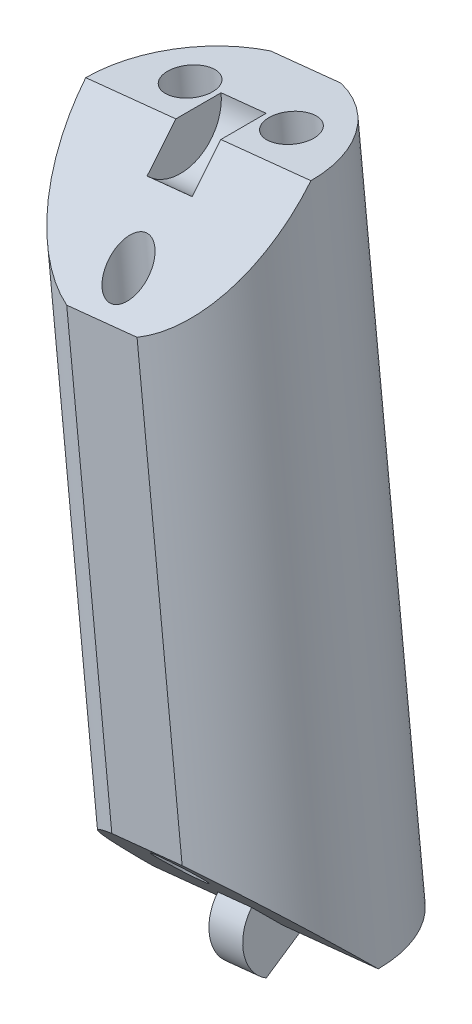
ISO-10303-21;
HEADER;
FILE_DESCRIPTION(('STEP AP214'),'2;1');
FILE_NAME('part.step','',(''),(''),'','','');
FILE_SCHEMA(('AUTOMOTIVE_DESIGN { 1 0 10303 214 1 1 1 1 }'));
ENDSEC;
DATA;
#1=APPLICATION_CONTEXT('core data for automotive mechanical design processes');
#2=APPLICATION_PROTOCOL_DEFINITION('international standard','automotive_design',2000,#1);
#3=PRODUCT_CONTEXT('',#1,'mechanical');
#4=PRODUCT('Part','Part','',(#3));
#5=PRODUCT_RELATED_PRODUCT_CATEGORY('part','',(#4));
#6=PRODUCT_DEFINITION_FORMATION('','',#4);
#7=PRODUCT_DEFINITION_CONTEXT('part definition',#1,'design');
#8=PRODUCT_DEFINITION('design','',#6,#7);
#9=PRODUCT_DEFINITION_SHAPE('','',#8);
#10=(LENGTH_UNIT() NAMED_UNIT(*) SI_UNIT(.MILLI.,.METRE.));
#11=(NAMED_UNIT(*) PLANE_ANGLE_UNIT() SI_UNIT($,.RADIAN.));
#12=(NAMED_UNIT(*) SI_UNIT($,.STERADIAN.) SOLID_ANGLE_UNIT());
#13=UNCERTAINTY_MEASURE_WITH_UNIT(LENGTH_MEASURE(1.E-05),#10,'distance_accuracy_value','');
#14=(GEOMETRIC_REPRESENTATION_CONTEXT(3) GLOBAL_UNCERTAINTY_ASSIGNED_CONTEXT((#13)) GLOBAL_UNIT_ASSIGNED_CONTEXT((#10,
#11,#12)) REPRESENTATION_CONTEXT('',''));
#15=CARTESIAN_POINT('',(0.,0.,0.));
#16=DIRECTION('',(0.,0.,1.));
#17=DIRECTION('',(1.,0.,0.));
#18=AXIS2_PLACEMENT_3D('',#15,#16,#17);
#19=CARTESIAN_POINT('',(-5.21308669792322,151.397041510452,0.));
#20=DIRECTION('',(-0.103150523023817,0.994665757729657,0.));
#21=DIRECTION('',(-0.994665757729657,-0.103150523023817,0.));
#22=AXIS2_PLACEMENT_3D('',#19,#20,#21);
#23=CYLINDRICAL_SURFACE('',#22,8.);
#24=CARTESIAN_POINT('',(-5.21308669792322,151.397041510452,0.));
#25=DIRECTION('',(0.103150523023817,-0.994665757729657,0.));
#26=DIRECTION('',(0.994665757729657,0.103150523023817,0.));
#27=AXIS2_PLACEMENT_3D('',#24,#25,#26);
#28=CIRCLE('',#27,8.);
#29=CARTESIAN_POINT('',(-2.72841243148436,151.654711434379,-7.6));
#30=VERTEX_POINT('',#29);
#31=CARTESIAN_POINT('',(2.74423936391403,152.222245694643,0.));
#32=VERTEX_POINT('',#31);
#33=EDGE_CURVE('E156',#30,#32,#28,.T.);
#34=ORIENTED_EDGE('',*,*,#33,.F.);
#35=DIRECTION('',(-0.103150523023817,0.994665757729657,0.));
#36=VECTOR('',#35,1.);
#37=CARTESIAN_POINT('',(-2.72841243148436,151.654711434379,-7.6));
#38=LINE('',#37,#36);
#39=CARTESIAN_POINT('',(-7.48403157112503,197.512467423771,-7.6));
#40=VERTEX_POINT('',#39);
#41=EDGE_CURVE('E11',#30,#40,#38,.T.);
#42=ORIENTED_EDGE('',*,*,#41,.T.);
#43=CARTESIAN_POINT('',(-9.9687058375639,197.254797499844,0.));
#44=DIRECTION('',(0.103150523023817,-0.994665757729657,0.));
#45=DIRECTION('',(0.994665757729657,0.103150523023817,0.));
#46=AXIS2_PLACEMENT_3D('',#43,#44,#45);
#47=CIRCLE('',#46,8.);
#48=CARTESIAN_POINT('',(-2.01137977572664,198.080001684034,0.));
#49=VERTEX_POINT('',#48);
#50=EDGE_CURVE('E148',#40,#49,#47,.T.);
#51=ORIENTED_EDGE('',*,*,#50,.T.);
#52=CARTESIAN_POINT('',(-9.9687058375639,197.254797499844,0.));
#53=DIRECTION('',(0.0729384343130804,-0.703334902304701,-0.707106781186543));
#54=DIRECTION('',(-0.0729384343130795,0.703334902304692,-0.707106781186552));
#55=AXIS2_PLACEMENT_3D('',#52,#53,#54);
#56=ELLIPSE('',#55,11.3137084989847,8.);
#57=CARTESIAN_POINT('',(-6.70008759614404,189.953007665026,7.6));
#58=VERTEX_POINT('',#57);
#59=EDGE_CURVE('E202',#49,#58,#56,.T.);
#60=ORIENTED_EDGE('',*,*,#59,.T.);
#61=DIRECTION('',(-0.103150523023817,0.994665757729657,0.));
#62=VECTOR('',#61,1.);
#63=CARTESIAN_POINT('',(-2.72841243148436,151.654711434379,7.6));
#64=LINE('',#63,#62);
#65=CARTESIAN_POINT('',(-3.51235640646537,159.214171193124,7.6));
#66=VERTEX_POINT('',#65);
#67=EDGE_CURVE('E174',#58,#66,#64,.F.);
#68=ORIENTED_EDGE('',*,*,#67,.T.);
#69=CARTESIAN_POINT('',(-5.21308669792323,151.397041510452,0.));
#70=DIRECTION('',(-0.0729384343130804,0.703334902304701,-0.707106781186543));
#71=DIRECTION('',(-0.0729384343130795,0.703334902304692,0.707106781186552));
#72=AXIS2_PLACEMENT_3D('',#69,#70,#71);
#73=ELLIPSE('',#72,11.3137084989847,8.);
#74=EDGE_CURVE('E207',#66,#32,#73,.T.);
#75=ORIENTED_EDGE('',*,*,#74,.T.);
#76=EDGE_LOOP('',(#34,#42,#51,#60,#68,#75));
#77=FACE_BOUND('',#76,.T.);
#78=ADVANCED_FACE('F39',(#77),#23,.T.);
#79=CARTESIAN_POINT('',(-9.9687058375639,197.254797499844,0.));
#80=DIRECTION('',(0.103150523023817,-0.994665757729657,0.));
#81=DIRECTION('',(0.994665757729657,0.103150523023817,0.));
#82=AXIS2_PLACEMENT_3D('',#79,#80,#81);
#83=PLANE('',#82);
#84=CARTESIAN_POINT('',(-6.38790910973713,197.62613938273,-3.));
#85=DIRECTION('',(0.103150523023817,-0.994665757729657,0.));
#86=DIRECTION('',(0.994665757729657,0.103150523023817,0.));
#87=AXIS2_PLACEMENT_3D('',#84,#85,#86);
#88=CIRCLE('',#87,1.6);
#89=CARTESIAN_POINT('',(-4.79644389736968,197.791180219568,-3.));
#90=VERTEX_POINT('',#89);
#91=EDGE_CURVE('E189',#90,#90,#88,.T.);
#92=ORIENTED_EDGE('',*,*,#91,.T.);
#93=EDGE_LOOP('',(#92));
#94=FACE_BOUND('',#93,.T.);
#95=CARTESIAN_POINT('',(-13.5495025653907,196.883455616958,-3.));
#96=DIRECTION('',(0.103150523023817,-0.994665757729657,0.));
#97=DIRECTION('',(0.994665757729657,0.103150523023817,0.));
#98=AXIS2_PLACEMENT_3D('',#95,#96,#97);
#99=CIRCLE('',#98,1.6);
#100=CARTESIAN_POINT('',(-11.9580373530232,197.048496453796,-3.));
#101=VERTEX_POINT('',#100);
#102=EDGE_CURVE('E184',#101,#101,#99,.T.);
#103=ORIENTED_EDGE('',*,*,#102,.T.);
#104=EDGE_LOOP('',(#103));
#105=FACE_BOUND('',#104,.T.);
#106=ORIENTED_EDGE('',*,*,#50,.F.);
#107=DIRECTION('',(0.994665757729657,0.103150523023816,0.));
#108=VECTOR('',#107,1.);
#109=CARTESIAN_POINT('',(-12.4533801040028,196.997127575917,-7.6));
#110=LINE('',#109,#108);
#111=CARTESIAN_POINT('',(-12.4533801040028,196.997127575917,-7.6));
#112=VERTEX_POINT('',#111);
#113=EDGE_CURVE('E134',#112,#40,#110,.T.);
#114=ORIENTED_EDGE('',*,*,#113,.F.);
#115=CARTESIAN_POINT('',(-17.9260318994012,196.429593315653,0.));
#116=VERTEX_POINT('',#115);
#117=EDGE_CURVE('E146',#116,#112,#47,.T.);
#118=ORIENTED_EDGE('',*,*,#117,.F.);
#119=DIRECTION('',(0.994665757729657,0.103150523023817,0.));
#120=VECTOR('',#119,1.);
#121=CARTESIAN_POINT('',(-9.9687058375639,197.254797499844,0.));
#122=LINE('',#121,#120);
#123=CARTESIAN_POINT('',(-11.5601710499314,197.089756663006,0.));
#124=VERTEX_POINT('',#123);
#125=EDGE_CURVE('E165',#116,#124,#122,.T.);
#126=ORIENTED_EDGE('',*,*,#125,.T.);
#127=DIRECTION('',(0.,0.,-1.));
#128=VECTOR('',#127,1.);
#129=CARTESIAN_POINT('',(-11.5601710499314,197.089756663006,0.));
#130=LINE('',#129,#128);
#131=CARTESIAN_POINT('',(-11.5601710499314,197.089756663006,-3.2));
#132=VERTEX_POINT('',#131);
#133=EDGE_CURVE('E256',#124,#132,#130,.T.);
#134=ORIENTED_EDGE('',*,*,#133,.T.);
#135=DIRECTION('',(-0.994665757729657,-0.103150523023817,0.));
#136=VECTOR('',#135,1.);
#137=CARTESIAN_POINT('',(-8.37724062519646,197.419838336682,-3.2));
#138=LINE('',#137,#136);
#139=CARTESIAN_POINT('',(-8.37724062519646,197.419838336682,-3.2));
#140=VERTEX_POINT('',#139);
#141=EDGE_CURVE('E269',#140,#132,#138,.T.);
#142=ORIENTED_EDGE('',*,*,#141,.F.);
#143=DIRECTION('',(0.,0.,-1.));
#144=VECTOR('',#143,1.);
#145=CARTESIAN_POINT('',(-8.37724062519647,197.419838336682,0.));
#146=LINE('',#145,#144);
#147=CARTESIAN_POINT('',(-8.37724062519647,197.419838336682,0.));
#148=VERTEX_POINT('',#147);
#149=EDGE_CURVE('E257',#148,#140,#146,.T.);
#150=ORIENTED_EDGE('',*,*,#149,.F.);
#151=EDGE_CURVE('E169',#148,#49,#122,.T.);
#152=ORIENTED_EDGE('',*,*,#151,.T.);
#153=EDGE_LOOP('',(#106,#114,#118,#126,#134,#142,#150,#152));
#154=FACE_BOUND('',#153,.T.);
#155=ADVANCED_FACE('F144',(#94,#105,#154),#83,.F.);
#156=CARTESIAN_POINT('',(2.69363943169702,198.567929601841,0.));
#157=DIRECTION('',(0.0729384343130804,-0.703334902304701,-0.707106781186543));
#158=DIRECTION('',(0.,0.708995228875744,-0.705213276556412));
#159=AXIS2_PLACEMENT_3D('',#156,#157,#158);
#160=PLANE('',#159);
#161=CARTESIAN_POINT('',(-9.40137796093292,191.784135832331,5.5));
#162=DIRECTION('',(0.0729384343130804,-0.703334902304701,-0.707106781186543));
#163=DIRECTION('',(-0.0729384343130795,0.703334902304692,-0.707106781186552));
#164=AXIS2_PLACEMENT_3D('',#161,#162,#163);
#165=ELLIPSE('',#164,1.97989898732232,1.4);
#166=CARTESIAN_POINT('',(-9.54578869316626,193.176667893152,4.1));
#167=VERTEX_POINT('',#166);
#168=EDGE_CURVE('E179',#167,#167,#165,.T.);
#169=ORIENTED_EDGE('',*,*,#168,.T.);
#170=EDGE_LOOP('',(#169));
#171=FACE_BOUND('',#170,.T.);
#172=CARTESIAN_POINT('',(-11.6694361290218,189.437667817172,7.6));
#173=VERTEX_POINT('',#172);
#174=EDGE_CURVE('E153',#173,#116,#56,.T.);
#175=ORIENTED_EDGE('',*,*,#174,.F.);
#176=DIRECTION('',(0.994665757729657,0.103150523023817,0.));
#177=VECTOR('',#176,1.);
#178=CARTESIAN_POINT('',(3.47758340667802,191.008469843096,7.6));
#179=LINE('',#178,#177);
#180=EDGE_CURVE('E198',#173,#58,#179,.T.);
#181=ORIENTED_EDGE('',*,*,#180,.T.);
#182=ORIENTED_EDGE('',*,*,#59,.F.);
#183=ORIENTED_EDGE('',*,*,#151,.F.);
#184=DIRECTION('',(-0.0729384343130776,0.703334902304677,-0.707106781186567));
#185=VECTOR('',#184,1.);
#186=CARTESIAN_POINT('',(-8.14383763539462,195.169166649307,2.26274169979702));
#187=LINE('',#186,#185);
#188=CARTESIAN_POINT('',(-8.14383763539462,195.169166649307,2.26274169979702));
#189=VERTEX_POINT('',#188);
#190=EDGE_CURVE('E266',#189,#148,#187,.T.);
#191=ORIENTED_EDGE('',*,*,#190,.F.);
#192=DIRECTION('',(-0.994665757729657,-0.103150523023817,0.));
#193=VECTOR('',#192,1.);
#194=CARTESIAN_POINT('',(-8.14383763539462,195.169166649307,2.26274169979702));
#195=LINE('',#194,#193);
#196=CARTESIAN_POINT('',(-11.3267680601295,194.839084975631,2.26274169979702));
#197=VERTEX_POINT('',#196);
#198=EDGE_CURVE('E278',#189,#197,#195,.T.);
#199=ORIENTED_EDGE('',*,*,#198,.T.);
#200=DIRECTION('',(-0.0729384343130776,0.703334902304677,-0.707106781186567));
#201=VECTOR('',#200,1.);
#202=CARTESIAN_POINT('',(-11.3267680601295,194.839084975631,2.26274169979702));
#203=LINE('',#202,#201);
#204=EDGE_CURVE('E262',#197,#124,#203,.T.);
#205=ORIENTED_EDGE('',*,*,#204,.T.);
#206=ORIENTED_EDGE('',*,*,#125,.F.);
#207=EDGE_LOOP('',(#175,#181,#182,#183,#191,#199,#205,#206));
#208=FACE_BOUND('',#207,.T.);
#209=ADVANCED_FACE('F196',(#171,#208),#160,.F.);
#210=CARTESIAN_POINT('',(-5.21308669792322,151.397041510452,0.));
#211=DIRECTION('',(0.103150523023817,-0.994665757729657,0.));
#212=DIRECTION('',(0.994665757729657,0.103150523023817,0.));
#213=AXIS2_PLACEMENT_3D('',#210,#211,#212);
#214=PLANE('',#213);
#215=DIRECTION('',(-0.994665757729657,-0.103150523023817,0.));
#216=VECTOR('',#215,1.);
#217=CARTESIAN_POINT('',(-5.21308669792322,151.397041510452,-7.6));
#218=LINE('',#217,#216);
#219=CARTESIAN_POINT('',(-7.69776096436209,151.139371586525,-7.6));
#220=VERTEX_POINT('',#219);
#221=EDGE_CURVE('E55',#30,#220,#218,.T.);
#222=ORIENTED_EDGE('',*,*,#221,.F.);
#223=ORIENTED_EDGE('',*,*,#33,.T.);
#224=DIRECTION('',(0.994665757729657,0.103150523023817,0.));
#225=VECTOR('',#224,1.);
#226=CARTESIAN_POINT('',(-5.21308669792322,151.397041510452,0.));
#227=LINE('',#226,#225);
#228=CARTESIAN_POINT('',(-4.01948778864765,151.520822138081,0.));
#229=VERTEX_POINT('',#228);
#230=EDGE_CURVE('E168',#229,#32,#227,.T.);
#231=ORIENTED_EDGE('',*,*,#230,.F.);
#232=DIRECTION('',(0.,0.,-1.));
#233=VECTOR('',#232,1.);
#234=CARTESIAN_POINT('',(-4.01948778864765,151.520822138081,0.));
#235=LINE('',#234,#233);
#236=CARTESIAN_POINT('',(-4.01948778864765,151.520822138081,-2.8));
#237=VERTEX_POINT('',#236);
#238=EDGE_CURVE('E282',#229,#237,#235,.T.);
#239=ORIENTED_EDGE('',*,*,#238,.T.);
#240=DIRECTION('',(0.994665757729657,0.103150523023817,0.));
#241=VECTOR('',#240,1.);
#242=CARTESIAN_POINT('',(-6.40668560719883,151.273260882823,-2.8));
#243=LINE('',#242,#241);
#244=CARTESIAN_POINT('',(-6.40668560719883,151.273260882823,-2.8));
#245=VERTEX_POINT('',#244);
#246=EDGE_CURVE('E203',#245,#237,#243,.T.);
#247=ORIENTED_EDGE('',*,*,#246,.F.);
#248=DIRECTION('',(0.,0.,-1.));
#249=VECTOR('',#248,1.);
#250=CARTESIAN_POINT('',(-6.40668560719883,151.273260882823,0.));
#251=LINE('',#250,#249);
#252=CARTESIAN_POINT('',(-6.40668560719883,151.273260882823,0.));
#253=VERTEX_POINT('',#252);
#254=EDGE_CURVE('E237',#253,#245,#251,.T.);
#255=ORIENTED_EDGE('',*,*,#254,.F.);
#256=CARTESIAN_POINT('',(-13.1704127597605,150.571837326261,0.));
#257=VERTEX_POINT('',#256);
#258=EDGE_CURVE('E170',#257,#253,#227,.T.);
#259=ORIENTED_EDGE('',*,*,#258,.F.);
#260=EDGE_CURVE('E160',#257,#220,#28,.T.);
#261=ORIENTED_EDGE('',*,*,#260,.T.);
#262=EDGE_LOOP('',(#222,#223,#231,#239,#247,#255,#259,#261));
#263=FACE_BOUND('',#262,.T.);
#264=CARTESIAN_POINT('',(-1.63228997009646,151.768383393338,-3.));
#265=DIRECTION('',(0.103150523023817,-0.994665757729657,0.));
#266=DIRECTION('',(0.994665757729657,0.103150523023817,0.));
#267=AXIS2_PLACEMENT_3D('',#264,#265,#266);
#268=CIRCLE('',#267,1.6);
#269=CARTESIAN_POINT('',(-0.0408247577290094,151.933424230176,-3.));
#270=VERTEX_POINT('',#269);
#271=EDGE_CURVE('E185',#270,#270,#268,.T.);
#272=ORIENTED_EDGE('',*,*,#271,.F.);
#273=EDGE_LOOP('',(#272));
#274=FACE_BOUND('',#273,.T.);
#275=CARTESIAN_POINT('',(-8.79388342574999,151.025699627566,-3.));
#276=DIRECTION('',(0.103150523023817,-0.994665757729657,0.));
#277=DIRECTION('',(0.994665757729657,0.103150523023817,0.));
#278=AXIS2_PLACEMENT_3D('',#275,#276,#277);
#279=CIRCLE('',#278,1.6);
#280=CARTESIAN_POINT('',(-7.20241821338254,151.190740464404,-3.));
#281=VERTEX_POINT('',#280);
#282=EDGE_CURVE('E180',#281,#281,#279,.T.);
#283=ORIENTED_EDGE('',*,*,#282,.F.);
#284=EDGE_LOOP('',(#283));
#285=FACE_BOUND('',#284,.T.);
#286=ADVANCED_FACE('F232',(#263,#274,#285),#214,.T.);
#287=CARTESIAN_POINT('',(7.44925857133769,152.710173612449,0.));
#288=DIRECTION('',(-0.0729384343130804,0.703334902304701,-0.707106781186543));
#289=DIRECTION('',(0.,0.708995228875744,0.705213276556412));
#290=AXIS2_PLACEMENT_3D('',#287,#288,#289);
#291=PLANE('',#290);
#292=CARTESIAN_POINT('',(-5.78041457455422,156.867703177965,5.5));
#293=DIRECTION('',(-0.0729384343130804,0.703334902304701,-0.707106781186543));
#294=DIRECTION('',(-0.0729384343130795,0.703334902304692,0.707106781186552));
#295=AXIS2_PLACEMENT_3D('',#292,#293,#294);
#296=ELLIPSE('',#295,1.97989898732232,1.4);
#297=CARTESIAN_POINT('',(-5.92482530678756,158.260235238787,6.9));
#298=VERTEX_POINT('',#297);
#299=EDGE_CURVE('E175',#298,#298,#296,.T.);
#300=ORIENTED_EDGE('',*,*,#299,.T.);
#301=EDGE_LOOP('',(#300));
#302=FACE_BOUND('',#301,.T.);
#303=ORIENTED_EDGE('',*,*,#74,.F.);
#304=DIRECTION('',(-0.994665757729657,-0.103150523023817,0.));
#305=VECTOR('',#304,1.);
#306=CARTESIAN_POINT('',(6.6653145963567,160.269633371195,7.6));
#307=LINE('',#306,#305);
#308=CARTESIAN_POINT('',(-8.48170493934309,158.69883134527,7.6));
#309=VERTEX_POINT('',#308);
#310=EDGE_CURVE('E63',#66,#309,#307,.T.);
#311=ORIENTED_EDGE('',*,*,#310,.T.);
#312=EDGE_CURVE('E162',#257,#309,#73,.T.);
#313=ORIENTED_EDGE('',*,*,#312,.F.);
#314=ORIENTED_EDGE('',*,*,#258,.T.);
#315=DIRECTION('',(0.0729384343130814,-0.703334902304696,-0.707106781186548));
#316=VECTOR('',#315,1.);
#317=CARTESIAN_POINT('',(-6.61091322327545,153.242598609277,1.97989898732232));
#318=LINE('',#317,#316);
#319=CARTESIAN_POINT('',(-6.61091322327545,153.242598609277,1.97989898732232));
#320=VERTEX_POINT('',#319);
#321=EDGE_CURVE('E239',#320,#253,#318,.T.);
#322=ORIENTED_EDGE('',*,*,#321,.F.);
#323=DIRECTION('',(0.994665757729657,0.103150523023817,0.));
#324=VECTOR('',#323,1.);
#325=CARTESIAN_POINT('',(-6.61091322327545,153.242598609277,1.97989898732232));
#326=LINE('',#325,#324);
#327=CARTESIAN_POINT('',(-4.22371540472428,153.490159864534,1.97989898732232));
#328=VERTEX_POINT('',#327);
#329=EDGE_CURVE('E295',#320,#328,#326,.T.);
#330=ORIENTED_EDGE('',*,*,#329,.T.);
#331=DIRECTION('',(0.0729384343130814,-0.703334902304696,-0.707106781186548));
#332=VECTOR('',#331,1.);
#333=CARTESIAN_POINT('',(-4.22371540472428,153.490159864534,1.97989898732232));
#334=LINE('',#333,#332);
#335=EDGE_CURVE('E225',#328,#229,#334,.T.);
#336=ORIENTED_EDGE('',*,*,#335,.T.);
#337=ORIENTED_EDGE('',*,*,#230,.T.);
#338=EDGE_LOOP('',(#303,#311,#313,#314,#322,#330,#336,#337));
#339=FACE_BOUND('',#338,.T.);
#340=ADVANCED_FACE('F222',(#302,#339),#291,.F.);
#341=ORIENTED_EDGE('',*,*,#117,.T.);
#342=DIRECTION('',(-0.103150523023817,0.994665757729657,0.));
#343=VECTOR('',#342,1.);
#344=CARTESIAN_POINT('',(-7.69776096436209,151.139371586525,-7.6));
#345=LINE('',#344,#343);
#346=EDGE_CURVE('E48',#112,#220,#345,.F.);
#347=ORIENTED_EDGE('',*,*,#346,.T.);
#348=ORIENTED_EDGE('',*,*,#260,.F.);
#349=ORIENTED_EDGE('',*,*,#312,.T.);
#350=DIRECTION('',(-0.103150523023817,0.994665757729657,0.));
#351=VECTOR('',#350,1.);
#352=CARTESIAN_POINT('',(-7.69776096436208,151.139371586525,7.6));
#353=LINE('',#352,#351);
#354=EDGE_CURVE('E140',#309,#173,#353,.T.);
#355=ORIENTED_EDGE('',*,*,#354,.T.);
#356=ORIENTED_EDGE('',*,*,#174,.T.);
#357=EDGE_LOOP('',(#341,#347,#348,#349,#355,#356));
#358=FACE_BOUND('',#357,.T.);
#359=ADVANCED_FACE('F41',(#358),#23,.T.);
#360=CARTESIAN_POINT('',(-6.40668560719883,151.273260882823,-2.8));
#361=DIRECTION('',(-0.089330973352277,0.861405814468381,0.499999999999999));
#362=DIRECTION('',(0.,-0.502007025803863,0.864863541862854));
#363=AXIS2_PLACEMENT_3D('',#360,#361,#362);
#364=PLANE('',#363);
#365=DIRECTION('',(0.0515752615119078,-0.497332878864828,0.866025403784439));
#366=VECTOR('',#365,1.);
#367=CARTESIAN_POINT('',(-4.01948778864765,151.520822138081,-2.8));
#368=LINE('',#367,#366);
#369=CARTESIAN_POINT('',(-3.76936106326128,149.108885857569,1.40000000000002));
#370=VERTEX_POINT('',#369);
#371=EDGE_CURVE('E298',#237,#370,#368,.T.);
#372=ORIENTED_EDGE('',*,*,#371,.T.);
#373=DIRECTION('',(0.994665757729657,0.103150523023817,0.));
#374=VECTOR('',#373,1.);
#375=CARTESIAN_POINT('',(-6.15655888181245,148.861324602312,1.40000000000002));
#376=LINE('',#375,#374);
#377=CARTESIAN_POINT('',(-6.15655888181245,148.861324602312,1.40000000000002));
#378=VERTEX_POINT('',#377);
#379=EDGE_CURVE('E209',#378,#370,#376,.T.);
#380=ORIENTED_EDGE('',*,*,#379,.F.);
#381=DIRECTION('',(0.0515752615119078,-0.497332878864828,0.866025403784439));
#382=VECTOR('',#381,1.);
#383=CARTESIAN_POINT('',(-6.40668560719883,151.273260882823,-2.8));
#384=LINE('',#383,#382);
#385=EDGE_CURVE('E287',#245,#378,#384,.T.);
#386=ORIENTED_EDGE('',*,*,#385,.F.);
#387=ORIENTED_EDGE('',*,*,#246,.T.);
#388=EDGE_LOOP('',(#372,#380,#386,#387));
#389=FACE_BOUND('',#388,.T.);
#390=ADVANCED_FACE('F318',(#389),#364,.F.);
#391=CARTESIAN_POINT('',(-6.40668560719883,151.273260882823,0.));
#392=DIRECTION('',(0.994665757729657,0.103150523023817,0.));
#393=DIRECTION('',(-0.103150523023817,0.994665757729657,0.));
#394=AXIS2_PLACEMENT_3D('',#391,#392,#393);
#395=CYLINDRICAL_SURFACE('',#394,2.8);
#396=CARTESIAN_POINT('',(-4.01948778864765,151.520822138081,0.));
#397=DIRECTION('',(-0.994665757729657,-0.103150523023817,0.));
#398=DIRECTION('',(-0.103150523023817,0.994665757729657,0.));
#399=AXIS2_PLACEMENT_3D('',#396,#397,#398);
#400=CIRCLE('',#399,2.8);
#401=EDGE_CURVE('E301',#370,#328,#400,.T.);
#402=ORIENTED_EDGE('',*,*,#401,.T.);
#403=ORIENTED_EDGE('',*,*,#329,.F.);
#404=CARTESIAN_POINT('',(-6.40668560719883,151.273260882823,0.));
#405=DIRECTION('',(-0.994665757729657,-0.103150523023817,0.));
#406=DIRECTION('',(-0.103150523023817,0.994665757729657,0.));
#407=AXIS2_PLACEMENT_3D('',#404,#405,#406);
#408=CIRCLE('',#407,2.8);
#409=EDGE_CURVE('E290',#378,#320,#408,.T.);
#410=ORIENTED_EDGE('',*,*,#409,.F.);
#411=ORIENTED_EDGE('',*,*,#379,.T.);
#412=EDGE_LOOP('',(#402,#403,#410,#411));
#413=FACE_BOUND('',#412,.T.);
#414=ADVANCED_FACE('F313',(#413),#395,.T.);
#415=CARTESIAN_POINT('',(-6.40668560719883,151.273260882823,0.));
#416=DIRECTION('',(0.994665757729657,0.103150523023817,0.));
#417=DIRECTION('',(-0.103150523023817,0.994665757729657,0.));
#418=AXIS2_PLACEMENT_3D('',#415,#416,#417);
#419=PLANE('',#418);
#420=ORIENTED_EDGE('',*,*,#254,.T.);
#421=ORIENTED_EDGE('',*,*,#385,.T.);
#422=ORIENTED_EDGE('',*,*,#409,.T.);
#423=ORIENTED_EDGE('',*,*,#321,.T.);
#424=EDGE_LOOP('',(#420,#421,#422,#423));
#425=FACE_BOUND('',#424,.T.);
#426=ADVANCED_FACE('F320',(#425),#419,.F.);
#427=CARTESIAN_POINT('',(-4.01948778864765,151.520822138081,0.));
#428=DIRECTION('',(0.994665757729657,0.103150523023817,0.));
#429=DIRECTION('',(-0.103150523023817,0.994665757729657,0.));
#430=AXIS2_PLACEMENT_3D('',#427,#428,#429);
#431=PLANE('',#430);
#432=ORIENTED_EDGE('',*,*,#238,.F.);
#433=ORIENTED_EDGE('',*,*,#335,.F.);
#434=ORIENTED_EDGE('',*,*,#401,.F.);
#435=ORIENTED_EDGE('',*,*,#371,.F.);
#436=EDGE_LOOP('',(#432,#433,#434,#435));
#437=FACE_BOUND('',#436,.T.);
#438=ADVANCED_FACE('F317',(#437),#431,.T.);
#439=CARTESIAN_POINT('',(-8.37724062519647,197.419838336682,0.));
#440=DIRECTION('',(-0.994665757729657,-0.103150523023817,0.));
#441=DIRECTION('',(0.103150523023817,-0.994665757729657,0.));
#442=AXIS2_PLACEMENT_3D('',#439,#440,#441);
#443=CYLINDRICAL_SURFACE('',#442,3.2);
#444=CARTESIAN_POINT('',(-11.5601710499314,197.089756663006,0.));
#445=DIRECTION('',(-0.994665757729657,-0.103150523023817,0.));
#446=DIRECTION('',(0.103150523023817,-0.994665757729657,0.));
#447=AXIS2_PLACEMENT_3D('',#444,#445,#446);
#448=CIRCLE('',#447,3.2);
#449=EDGE_CURVE('E273',#132,#197,#448,.T.);
#450=ORIENTED_EDGE('',*,*,#449,.T.);
#451=ORIENTED_EDGE('',*,*,#198,.F.);
#452=CARTESIAN_POINT('',(-8.37724062519647,197.419838336682,0.));
#453=DIRECTION('',(-0.994665757729657,-0.103150523023817,0.));
#454=DIRECTION('',(0.103150523023817,-0.994665757729657,0.));
#455=AXIS2_PLACEMENT_3D('',#452,#453,#454);
#456=CIRCLE('',#455,3.2);
#457=EDGE_CURVE('E261',#140,#189,#456,.T.);
#458=ORIENTED_EDGE('',*,*,#457,.F.);
#459=ORIENTED_EDGE('',*,*,#141,.T.);
#460=EDGE_LOOP('',(#450,#451,#458,#459));
#461=FACE_BOUND('',#460,.T.);
#462=ADVANCED_FACE('F327',(#461),#443,.F.);
#463=CARTESIAN_POINT('',(-8.37724062519647,197.419838336682,0.));
#464=DIRECTION('',(-0.994665757729657,-0.103150523023817,0.));
#465=DIRECTION('',(0.103150523023817,-0.994665757729657,0.));
#466=AXIS2_PLACEMENT_3D('',#463,#464,#465);
#467=PLANE('',#466);
#468=ORIENTED_EDGE('',*,*,#149,.T.);
#469=ORIENTED_EDGE('',*,*,#457,.T.);
#470=ORIENTED_EDGE('',*,*,#190,.T.);
#471=EDGE_LOOP('',(#468,#469,#470));
#472=FACE_BOUND('',#471,.T.);
#473=ADVANCED_FACE('F368',(#472),#467,.T.);
#474=CARTESIAN_POINT('',(-11.5601710499314,197.089756663006,0.));
#475=DIRECTION('',(-0.994665757729657,-0.103150523023817,0.));
#476=DIRECTION('',(0.103150523023817,-0.994665757729657,0.));
#477=AXIS2_PLACEMENT_3D('',#474,#475,#476);
#478=PLANE('',#477);
#479=ORIENTED_EDGE('',*,*,#133,.F.);
#480=ORIENTED_EDGE('',*,*,#204,.F.);
#481=ORIENTED_EDGE('',*,*,#449,.F.);
#482=EDGE_LOOP('',(#479,#480,#481));
#483=FACE_BOUND('',#482,.T.);
#484=ADVANCED_FACE('F358',(#483),#478,.F.);
#485=CARTESIAN_POINT('',(-4.86825520861729,148.071880720716,5.5));
#486=DIRECTION('',(-0.103150523023817,0.994665757729657,0.));
#487=DIRECTION('',(-0.994665757729657,-0.103150523023817,0.));
#488=AXIS2_PLACEMENT_3D('',#485,#486,#487);
#489=CYLINDRICAL_SURFACE('',#488,1.4);
#490=ORIENTED_EDGE('',*,*,#299,.F.);
#491=EDGE_LOOP('',(#490));
#492=FACE_BOUND('',#491,.T.);
#493=ORIENTED_EDGE('',*,*,#168,.F.);
#494=EDGE_LOOP('',(#493));
#495=FACE_BOUND('',#494,.T.);
#496=ADVANCED_FACE('F355',(#492,#495),#489,.F.);
#497=CARTESIAN_POINT('',(-8.44905193644405,147.70053883783,-3.));
#498=DIRECTION('',(-0.103150523023817,0.994665757729657,0.));
#499=DIRECTION('',(-0.994665757729657,-0.103150523023817,0.));
#500=AXIS2_PLACEMENT_3D('',#497,#498,#499);
#501=CYLINDRICAL_SURFACE('',#500,1.6);
#502=ORIENTED_EDGE('',*,*,#282,.T.);
#503=EDGE_LOOP('',(#502));
#504=FACE_BOUND('',#503,.T.);
#505=ORIENTED_EDGE('',*,*,#102,.F.);
#506=EDGE_LOOP('',(#505));
#507=FACE_BOUND('',#506,.T.);
#508=ADVANCED_FACE('F357',(#504,#507),#501,.F.);
#509=CARTESIAN_POINT('',(-1.28745848079052,148.443222603602,-3.));
#510=DIRECTION('',(-0.103150523023817,0.994665757729657,0.));
#511=DIRECTION('',(-0.994665757729657,-0.103150523023817,0.));
#512=AXIS2_PLACEMENT_3D('',#509,#510,#511);
#513=CYLINDRICAL_SURFACE('',#512,1.6);
#514=ORIENTED_EDGE('',*,*,#271,.T.);
#515=EDGE_LOOP('',(#514));
#516=FACE_BOUND('',#515,.T.);
#517=ORIENTED_EDGE('',*,*,#91,.F.);
#518=EDGE_LOOP('',(#517));
#519=FACE_BOUND('',#518,.T.);
#520=ADVANCED_FACE('F365',(#516,#519),#513,.F.);
#521=CARTESIAN_POINT('',(-7.35292947505615,147.814210796789,7.6));
#522=DIRECTION('',(0.,0.,-1.));
#523=DIRECTION('',(-1.,0.,0.));
#524=AXIS2_PLACEMENT_3D('',#521,#522,#523);
#525=PLANE('',#524);
#526=ORIENTED_EDGE('',*,*,#354,.F.);
#527=ORIENTED_EDGE('',*,*,#310,.F.);
#528=ORIENTED_EDGE('',*,*,#67,.F.);
#529=ORIENTED_EDGE('',*,*,#180,.F.);
#530=EDGE_LOOP('',(#526,#527,#528,#529));
#531=FACE_BOUND('',#530,.T.);
#532=ADVANCED_FACE('F374',(#531),#525,.F.);
#533=CARTESIAN_POINT('',(-7.35292947505615,147.814210796789,-7.6));
#534=DIRECTION('',(0.,0.,1.));
#535=DIRECTION('',(1.,0.,0.));
#536=AXIS2_PLACEMENT_3D('',#533,#534,#535);
#537=PLANE('',#536);
#538=ORIENTED_EDGE('',*,*,#221,.T.);
#539=ORIENTED_EDGE('',*,*,#346,.F.);
#540=ORIENTED_EDGE('',*,*,#113,.T.);
#541=ORIENTED_EDGE('',*,*,#41,.F.);
#542=EDGE_LOOP('',(#538,#539,#540,#541));
#543=FACE_BOUND('',#542,.T.);
#544=ADVANCED_FACE('F133',(#543),#537,.F.);
#545=CLOSED_SHELL('',(#78,#155,#209,#286,#340,#359,#390,#414,#426,#438,#462,#473,#484,#496,#508,
#520,#532,#544));
#546=MANIFOLD_SOLID_BREP('B2',#545);
#547=ADVANCED_BREP_SHAPE_REPRESENTATION('',(#18,#546),#14);
#548=SHAPE_DEFINITION_REPRESENTATION(#9,#547);
ENDSEC;
END-ISO-10303-21;
